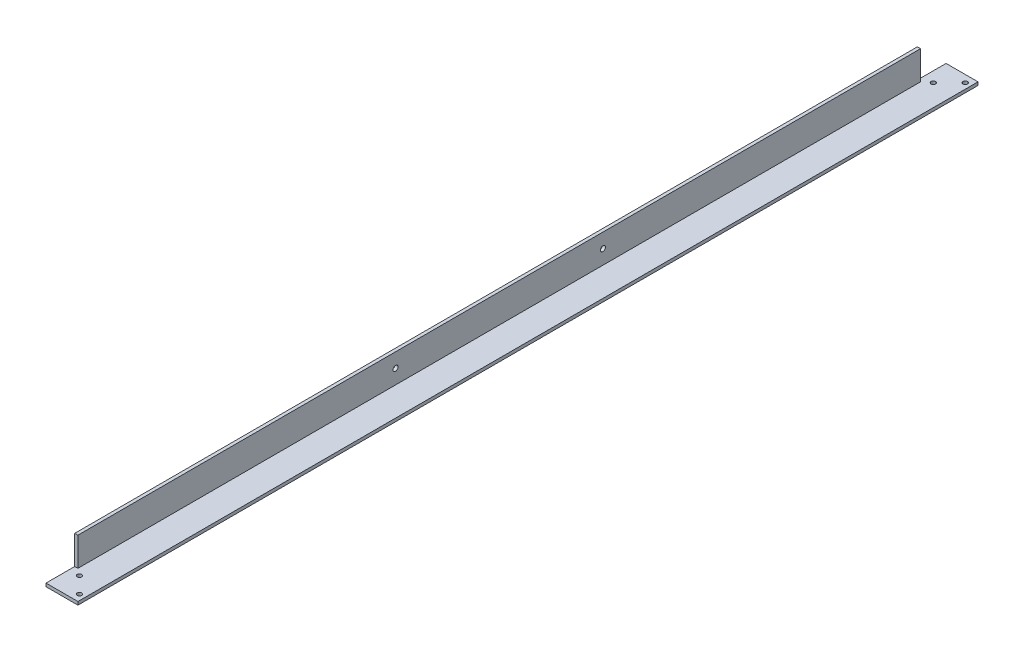
ISO-10303-21;
HEADER;
FILE_DESCRIPTION(('STEP AP214'),'2;1');
FILE_NAME('part.step','',(''),(''),'','','');
FILE_SCHEMA(('AUTOMOTIVE_DESIGN { 1 0 10303 214 1 1 1 1 }'));
ENDSEC;
DATA;
#1=APPLICATION_CONTEXT('core data for automotive mechanical design processes');
#2=APPLICATION_PROTOCOL_DEFINITION('international standard','automotive_design',2000,#1);
#3=PRODUCT_CONTEXT('',#1,'mechanical');
#4=PRODUCT('Part','Part','',(#3));
#5=PRODUCT_RELATED_PRODUCT_CATEGORY('part','',(#4));
#6=PRODUCT_DEFINITION_FORMATION('','',#4);
#7=PRODUCT_DEFINITION_CONTEXT('part definition',#1,'design');
#8=PRODUCT_DEFINITION('design','',#6,#7);
#9=PRODUCT_DEFINITION_SHAPE('','',#8);
#10=(LENGTH_UNIT() NAMED_UNIT(*) SI_UNIT(.MILLI.,.METRE.));
#11=(NAMED_UNIT(*) PLANE_ANGLE_UNIT() SI_UNIT($,.RADIAN.));
#12=(NAMED_UNIT(*) SI_UNIT($,.STERADIAN.) SOLID_ANGLE_UNIT());
#13=UNCERTAINTY_MEASURE_WITH_UNIT(LENGTH_MEASURE(1.E-05),#10,'distance_accuracy_value','');
#14=(GEOMETRIC_REPRESENTATION_CONTEXT(3) GLOBAL_UNCERTAINTY_ASSIGNED_CONTEXT((#13)) GLOBAL_UNIT_ASSIGNED_CONTEXT((#10,
#11,#12)) REPRESENTATION_CONTEXT('',''));
#15=CARTESIAN_POINT('',(0.,0.,0.));
#16=DIRECTION('',(0.,0.,1.));
#17=DIRECTION('',(1.,0.,0.));
#18=AXIS2_PLACEMENT_3D('',#15,#16,#17);
#19=CARTESIAN_POINT('',(0.,20.,564.));
#20=DIRECTION('',(1.,0.,0.));
#21=DIRECTION('',(0.,0.,-1.));
#22=AXIS2_PLACEMENT_3D('',#19,#20,#21);
#23=PLANE('',#22);
#24=CARTESIAN_POINT('',(0.,11.,217.));
#25=DIRECTION('',(-1.,0.,0.));
#26=DIRECTION('',(0.,0.,1.));
#27=AXIS2_PLACEMENT_3D('',#24,#25,#26);
#28=CIRCLE('',#27,1.59999999999999);
#29=CARTESIAN_POINT('',(0.,11.,218.6));
#30=VERTEX_POINT('',#29);
#31=EDGE_CURVE('E179',#30,#30,#28,.T.);
#32=ORIENTED_EDGE('',*,*,#31,.F.);
#33=EDGE_LOOP('',(#32));
#34=FACE_BOUND('',#33,.T.);
#35=CARTESIAN_POINT('',(0.,11.,347.));
#36=DIRECTION('',(-1.,0.,0.));
#37=DIRECTION('',(0.,0.,1.));
#38=AXIS2_PLACEMENT_3D('',#35,#36,#37);
#39=CIRCLE('',#38,1.59999999999996);
#40=CARTESIAN_POINT('',(0.,11.,348.6));
#41=VERTEX_POINT('',#40);
#42=EDGE_CURVE('E185',#41,#41,#39,.T.);
#43=ORIENTED_EDGE('',*,*,#42,.F.);
#44=EDGE_LOOP('',(#43));
#45=FACE_BOUND('',#44,.T.);
#46=DIRECTION('',(0.,0.,-1.));
#47=VECTOR('',#46,1.);
#48=CARTESIAN_POINT('',(0.,2.,564.));
#49=LINE('',#48,#47);
#50=CARTESIAN_POINT('',(0.,2.,564.));
#51=VERTEX_POINT('',#50);
#52=CARTESIAN_POINT('',(0.,2.,546.));
#53=VERTEX_POINT('',#52);
#54=EDGE_CURVE('E119',#51,#53,#49,.T.);
#55=ORIENTED_EDGE('',*,*,#54,.T.);
#56=DIRECTION('',(0.,1.,0.));
#57=VECTOR('',#56,1.);
#58=CARTESIAN_POINT('',(0.,20.,546.));
#59=LINE('',#58,#57);
#60=CARTESIAN_POINT('',(0.,20.,546.));
#61=VERTEX_POINT('',#60);
#62=EDGE_CURVE('E125',#53,#61,#59,.T.);
#63=ORIENTED_EDGE('',*,*,#62,.T.);
#64=DIRECTION('',(0.,0.,-1.));
#65=VECTOR('',#64,1.);
#66=CARTESIAN_POINT('',(0.,20.,564.));
#67=LINE('',#66,#65);
#68=CARTESIAN_POINT('',(0.,20.,18.));
#69=VERTEX_POINT('',#68);
#70=EDGE_CURVE('E164',#61,#69,#67,.T.);
#71=ORIENTED_EDGE('',*,*,#70,.T.);
#72=DIRECTION('',(0.,-1.,0.));
#73=VECTOR('',#72,1.);
#74=CARTESIAN_POINT('',(0.,20.,18.));
#75=LINE('',#74,#73);
#76=CARTESIAN_POINT('',(0.,2.,18.));
#77=VERTEX_POINT('',#76);
#78=EDGE_CURVE('E145',#69,#77,#75,.T.);
#79=ORIENTED_EDGE('',*,*,#78,.T.);
#80=DIRECTION('',(0.,0.,-1.));
#81=VECTOR('',#80,1.);
#82=CARTESIAN_POINT('',(0.,2.,0.));
#83=LINE('',#82,#81);
#84=CARTESIAN_POINT('',(0.,2.,0.));
#85=VERTEX_POINT('',#84);
#86=EDGE_CURVE('E148',#77,#85,#83,.T.);
#87=ORIENTED_EDGE('',*,*,#86,.T.);
#88=DIRECTION('',(0.,-1.,0.));
#89=VECTOR('',#88,1.);
#90=CARTESIAN_POINT('',(0.,20.,0.));
#91=LINE('',#90,#89);
#92=CARTESIAN_POINT('',(0.,0.,0.));
#93=VERTEX_POINT('',#92);
#94=EDGE_CURVE('E143',#85,#93,#91,.T.);
#95=ORIENTED_EDGE('',*,*,#94,.T.);
#96=DIRECTION('',(0.,0.,-1.));
#97=VECTOR('',#96,1.);
#98=CARTESIAN_POINT('',(0.,0.,564.));
#99=LINE('',#98,#97);
#100=CARTESIAN_POINT('',(0.,0.,564.));
#101=VERTEX_POINT('',#100);
#102=EDGE_CURVE('E11',#101,#93,#99,.T.);
#103=ORIENTED_EDGE('',*,*,#102,.F.);
#104=DIRECTION('',(0.,-1.,0.));
#105=VECTOR('',#104,1.);
#106=CARTESIAN_POINT('',(0.,20.,564.));
#107=LINE('',#106,#105);
#108=EDGE_CURVE('E85',#51,#101,#107,.T.);
#109=ORIENTED_EDGE('',*,*,#108,.F.);
#110=EDGE_LOOP('',(#55,#63,#71,#79,#87,#95,#103,#109));
#111=FACE_BOUND('',#110,.T.);
#112=ADVANCED_FACE('F43',(#34,#45,#111),#23,.F.);
#113=CARTESIAN_POINT('',(0.,0.,564.));
#114=DIRECTION('',(0.,1.,0.));
#115=DIRECTION('',(0.,0.,1.));
#116=AXIS2_PLACEMENT_3D('',#113,#114,#115);
#117=PLANE('',#116);
#118=CARTESIAN_POINT('',(16.48,0.,4.48000000000001));
#119=DIRECTION('',(0.,1.,0.));
#120=DIRECTION('',(1.,0.,0.));
#121=AXIS2_PLACEMENT_3D('',#118,#119,#120);
#122=CIRCLE('',#121,1.4);
#123=CARTESIAN_POINT('',(17.88,0.,4.48000000000001));
#124=VERTEX_POINT('',#123);
#125=EDGE_CURVE('E204',#124,#124,#122,.T.);
#126=ORIENTED_EDGE('',*,*,#125,.T.);
#127=EDGE_LOOP('',(#126));
#128=FACE_BOUND('',#127,.T.);
#129=CARTESIAN_POINT('',(16.48,0.,559.52));
#130=DIRECTION('',(0.,1.,0.));
#131=DIRECTION('',(-1.,0.,0.));
#132=AXIS2_PLACEMENT_3D('',#129,#130,#131);
#133=CIRCLE('',#132,1.39999999999999);
#134=CARTESIAN_POINT('',(15.08,0.,559.52));
#135=VERTEX_POINT('',#134);
#136=EDGE_CURVE('E198',#135,#135,#133,.T.);
#137=ORIENTED_EDGE('',*,*,#136,.T.);
#138=EDGE_LOOP('',(#137));
#139=FACE_BOUND('',#138,.T.);
#140=CARTESIAN_POINT('',(6.48,0.,14.48));
#141=DIRECTION('',(0.,1.,0.));
#142=DIRECTION('',(1.,0.,0.));
#143=AXIS2_PLACEMENT_3D('',#140,#141,#142);
#144=CIRCLE('',#143,1.4);
#145=CARTESIAN_POINT('',(7.88,0.,14.48));
#146=VERTEX_POINT('',#145);
#147=EDGE_CURVE('E192',#146,#146,#144,.T.);
#148=ORIENTED_EDGE('',*,*,#147,.T.);
#149=EDGE_LOOP('',(#148));
#150=FACE_BOUND('',#149,.T.);
#151=CARTESIAN_POINT('',(6.48,0.,549.52));
#152=DIRECTION('',(0.,1.,0.));
#153=DIRECTION('',(-1.,0.,0.));
#154=AXIS2_PLACEMENT_3D('',#151,#152,#153);
#155=CIRCLE('',#154,1.39999999999998);
#156=CARTESIAN_POINT('',(5.08000000000002,0.,549.52));
#157=VERTEX_POINT('',#156);
#158=EDGE_CURVE('E155',#157,#157,#155,.T.);
#159=ORIENTED_EDGE('',*,*,#158,.T.);
#160=EDGE_LOOP('',(#159));
#161=FACE_BOUND('',#160,.T.);
#162=DIRECTION('',(1.,0.,0.));
#163=VECTOR('',#162,1.);
#164=CARTESIAN_POINT('',(0.,0.,0.));
#165=LINE('',#164,#163);
#166=CARTESIAN_POINT('',(20.,0.,0.));
#167=VERTEX_POINT('',#166);
#168=EDGE_CURVE('E166',#93,#167,#165,.T.);
#169=ORIENTED_EDGE('',*,*,#168,.T.);
#170=DIRECTION('',(0.,0.,-1.));
#171=VECTOR('',#170,1.);
#172=CARTESIAN_POINT('',(20.,0.,564.));
#173=LINE('',#172,#171);
#174=CARTESIAN_POINT('',(20.,0.,564.));
#175=VERTEX_POINT('',#174);
#176=EDGE_CURVE('E51',#175,#167,#173,.T.);
#177=ORIENTED_EDGE('',*,*,#176,.F.);
#178=DIRECTION('',(1.,0.,0.));
#179=VECTOR('',#178,1.);
#180=CARTESIAN_POINT('',(0.,0.,564.));
#181=LINE('',#180,#179);
#182=EDGE_CURVE('E159',#101,#175,#181,.T.);
#183=ORIENTED_EDGE('',*,*,#182,.F.);
#184=ORIENTED_EDGE('',*,*,#102,.T.);
#185=EDGE_LOOP('',(#169,#177,#183,#184));
#186=FACE_BOUND('',#185,.T.);
#187=ADVANCED_FACE('F230',(#128,#139,#150,#161,#186),#117,.F.);
#188=CARTESIAN_POINT('',(20.,0.,564.));
#189=DIRECTION('',(-1.,0.,0.));
#190=DIRECTION('',(0.,0.,1.));
#191=AXIS2_PLACEMENT_3D('',#188,#189,#190);
#192=PLANE('',#191);
#193=DIRECTION('',(0.,1.,0.));
#194=VECTOR('',#193,1.);
#195=CARTESIAN_POINT('',(20.,0.,0.));
#196=LINE('',#195,#194);
#197=CARTESIAN_POINT('',(20.,2.,0.));
#198=VERTEX_POINT('',#197);
#199=EDGE_CURVE('E82',#167,#198,#196,.T.);
#200=ORIENTED_EDGE('',*,*,#199,.T.);
#201=DIRECTION('',(0.,0.,-1.));
#202=VECTOR('',#201,1.);
#203=CARTESIAN_POINT('',(20.,2.,564.));
#204=LINE('',#203,#202);
#205=CARTESIAN_POINT('',(20.,2.,564.));
#206=VERTEX_POINT('',#205);
#207=EDGE_CURVE('E175',#206,#198,#204,.T.);
#208=ORIENTED_EDGE('',*,*,#207,.F.);
#209=DIRECTION('',(0.,1.,0.));
#210=VECTOR('',#209,1.);
#211=CARTESIAN_POINT('',(20.,0.,564.));
#212=LINE('',#211,#210);
#213=EDGE_CURVE('E65',#175,#206,#212,.T.);
#214=ORIENTED_EDGE('',*,*,#213,.F.);
#215=ORIENTED_EDGE('',*,*,#176,.T.);
#216=EDGE_LOOP('',(#200,#208,#214,#215));
#217=FACE_BOUND('',#216,.T.);
#218=ADVANCED_FACE('F218',(#217),#192,.F.);
#219=CARTESIAN_POINT('',(20.,2.,564.));
#220=DIRECTION('',(0.,-1.,0.));
#221=DIRECTION('',(1.,0.,0.));
#222=AXIS2_PLACEMENT_3D('',#219,#220,#221);
#223=PLANE('',#222);
#224=CARTESIAN_POINT('',(16.48,2.,4.48000000000001));
#225=DIRECTION('',(0.,1.,0.));
#226=DIRECTION('',(1.,0.,0.));
#227=AXIS2_PLACEMENT_3D('',#224,#225,#226);
#228=CIRCLE('',#227,1.4);
#229=CARTESIAN_POINT('',(17.88,2.,4.48000000000001));
#230=VERTEX_POINT('',#229);
#231=EDGE_CURVE('E183',#230,#230,#228,.T.);
#232=ORIENTED_EDGE('',*,*,#231,.F.);
#233=EDGE_LOOP('',(#232));
#234=FACE_BOUND('',#233,.T.);
#235=CARTESIAN_POINT('',(16.48,2.,559.52));
#236=DIRECTION('',(0.,1.,0.));
#237=DIRECTION('',(-1.,0.,0.));
#238=AXIS2_PLACEMENT_3D('',#235,#236,#237);
#239=CIRCLE('',#238,1.39999999999999);
#240=CARTESIAN_POINT('',(15.08,2.,559.52));
#241=VERTEX_POINT('',#240);
#242=EDGE_CURVE('E201',#241,#241,#239,.T.);
#243=ORIENTED_EDGE('',*,*,#242,.F.);
#244=EDGE_LOOP('',(#243));
#245=FACE_BOUND('',#244,.T.);
#246=CARTESIAN_POINT('',(6.48,2.,14.48));
#247=DIRECTION('',(0.,1.,0.));
#248=DIRECTION('',(1.,0.,0.));
#249=AXIS2_PLACEMENT_3D('',#246,#247,#248);
#250=CIRCLE('',#249,1.4);
#251=CARTESIAN_POINT('',(7.88,2.,14.48));
#252=VERTEX_POINT('',#251);
#253=EDGE_CURVE('E195',#252,#252,#250,.T.);
#254=ORIENTED_EDGE('',*,*,#253,.F.);
#255=EDGE_LOOP('',(#254));
#256=FACE_BOUND('',#255,.T.);
#257=CARTESIAN_POINT('',(6.48,2.,549.52));
#258=DIRECTION('',(0.,1.,0.));
#259=DIRECTION('',(-1.,0.,0.));
#260=AXIS2_PLACEMENT_3D('',#257,#258,#259);
#261=CIRCLE('',#260,1.39999999999998);
#262=CARTESIAN_POINT('',(5.08000000000002,2.,549.52));
#263=VERTEX_POINT('',#262);
#264=EDGE_CURVE('E140',#263,#263,#261,.T.);
#265=ORIENTED_EDGE('',*,*,#264,.F.);
#266=EDGE_LOOP('',(#265));
#267=FACE_BOUND('',#266,.T.);
#268=DIRECTION('',(-1.,0.,0.));
#269=VECTOR('',#268,1.);
#270=CARTESIAN_POINT('',(20.,2.,0.));
#271=LINE('',#270,#269);
#272=EDGE_CURVE('E160',#198,#85,#271,.T.);
#273=ORIENTED_EDGE('',*,*,#272,.T.);
#274=ORIENTED_EDGE('',*,*,#86,.F.);
#275=DIRECTION('',(1.,0.,0.));
#276=VECTOR('',#275,1.);
#277=CARTESIAN_POINT('',(0.,2.,18.));
#278=LINE('',#277,#276);
#279=CARTESIAN_POINT('',(2.,2.,18.));
#280=VERTEX_POINT('',#279);
#281=EDGE_CURVE('E137',#77,#280,#278,.T.);
#282=ORIENTED_EDGE('',*,*,#281,.T.);
#283=DIRECTION('',(0.,0.,-1.));
#284=VECTOR('',#283,1.);
#285=CARTESIAN_POINT('',(2.,2.,564.));
#286=LINE('',#285,#284);
#287=CARTESIAN_POINT('',(2.,2.,546.));
#288=VERTEX_POINT('',#287);
#289=EDGE_CURVE('E121',#288,#280,#286,.T.);
#290=ORIENTED_EDGE('',*,*,#289,.F.);
#291=DIRECTION('',(1.,0.,0.));
#292=VECTOR('',#291,1.);
#293=CARTESIAN_POINT('',(0.,2.,546.));
#294=LINE('',#293,#292);
#295=EDGE_CURVE('E115',#53,#288,#294,.T.);
#296=ORIENTED_EDGE('',*,*,#295,.F.);
#297=ORIENTED_EDGE('',*,*,#54,.F.);
#298=DIRECTION('',(-1.,0.,0.));
#299=VECTOR('',#298,1.);
#300=CARTESIAN_POINT('',(20.,2.,564.));
#301=LINE('',#300,#299);
#302=EDGE_CURVE('E59',#206,#51,#301,.T.);
#303=ORIENTED_EDGE('',*,*,#302,.F.);
#304=ORIENTED_EDGE('',*,*,#207,.T.);
#305=EDGE_LOOP('',(#273,#274,#282,#290,#296,#297,#303,#304));
#306=FACE_BOUND('',#305,.T.);
#307=ADVANCED_FACE('F117',(#234,#245,#256,#267,#306),#223,.F.);
#308=CARTESIAN_POINT('',(2.,2.,564.));
#309=DIRECTION('',(-1.,0.,0.));
#310=DIRECTION('',(0.,0.,1.));
#311=AXIS2_PLACEMENT_3D('',#308,#309,#310);
#312=PLANE('',#311);
#313=CARTESIAN_POINT('',(2.,11.,217.));
#314=DIRECTION('',(-1.,0.,0.));
#315=DIRECTION('',(0.,0.,1.));
#316=AXIS2_PLACEMENT_3D('',#313,#314,#315);
#317=CIRCLE('',#316,1.59999999999999);
#318=CARTESIAN_POINT('',(2.,11.,218.6));
#319=VERTEX_POINT('',#318);
#320=EDGE_CURVE('E46',#319,#319,#317,.T.);
#321=ORIENTED_EDGE('',*,*,#320,.T.);
#322=EDGE_LOOP('',(#321));
#323=FACE_BOUND('',#322,.T.);
#324=CARTESIAN_POINT('',(2.,11.,347.));
#325=DIRECTION('',(-1.,0.,0.));
#326=DIRECTION('',(0.,0.,1.));
#327=AXIS2_PLACEMENT_3D('',#324,#325,#326);
#328=CIRCLE('',#327,1.59999999999996);
#329=CARTESIAN_POINT('',(2.,11.,348.6));
#330=VERTEX_POINT('',#329);
#331=EDGE_CURVE('E177',#330,#330,#328,.T.);
#332=ORIENTED_EDGE('',*,*,#331,.T.);
#333=EDGE_LOOP('',(#332));
#334=FACE_BOUND('',#333,.T.);
#335=DIRECTION('',(0.,0.,-1.));
#336=VECTOR('',#335,1.);
#337=CARTESIAN_POINT('',(2.,20.,564.));
#338=LINE('',#337,#336);
#339=CARTESIAN_POINT('',(2.,20.,546.));
#340=VERTEX_POINT('',#339);
#341=CARTESIAN_POINT('',(2.,20.,18.));
#342=VERTEX_POINT('',#341);
#343=EDGE_CURVE('E171',#340,#342,#338,.T.);
#344=ORIENTED_EDGE('',*,*,#343,.F.);
#345=DIRECTION('',(0.,1.,0.));
#346=VECTOR('',#345,1.);
#347=CARTESIAN_POINT('',(2.,20.,546.));
#348=LINE('',#347,#346);
#349=EDGE_CURVE('E135',#288,#340,#348,.T.);
#350=ORIENTED_EDGE('',*,*,#349,.F.);
#351=ORIENTED_EDGE('',*,*,#289,.T.);
#352=DIRECTION('',(0.,-1.,0.));
#353=VECTOR('',#352,1.);
#354=CARTESIAN_POINT('',(2.,20.,18.));
#355=LINE('',#354,#353);
#356=EDGE_CURVE('E149',#342,#280,#355,.T.);
#357=ORIENTED_EDGE('',*,*,#356,.F.);
#358=EDGE_LOOP('',(#344,#350,#351,#357));
#359=FACE_BOUND('',#358,.T.);
#360=ADVANCED_FACE('F217',(#323,#334,#359),#312,.F.);
#361=CARTESIAN_POINT('',(2.,20.,564.));
#362=DIRECTION('',(0.,-1.,0.));
#363=DIRECTION('',(0.,0.,-1.));
#364=AXIS2_PLACEMENT_3D('',#361,#362,#363);
#365=PLANE('',#364);
#366=ORIENTED_EDGE('',*,*,#70,.F.);
#367=DIRECTION('',(1.,0.,0.));
#368=VECTOR('',#367,1.);
#369=CARTESIAN_POINT('',(0.,20.,546.));
#370=LINE('',#369,#368);
#371=EDGE_CURVE('E124',#61,#340,#370,.T.);
#372=ORIENTED_EDGE('',*,*,#371,.T.);
#373=ORIENTED_EDGE('',*,*,#343,.T.);
#374=DIRECTION('',(1.,0.,0.));
#375=VECTOR('',#374,1.);
#376=CARTESIAN_POINT('',(0.,20.,18.));
#377=LINE('',#376,#375);
#378=EDGE_CURVE('E152',#69,#342,#377,.T.);
#379=ORIENTED_EDGE('',*,*,#378,.F.);
#380=EDGE_LOOP('',(#366,#372,#373,#379));
#381=FACE_BOUND('',#380,.T.);
#382=ADVANCED_FACE('F226',(#381),#365,.F.);
#383=CARTESIAN_POINT('',(0.,0.,564.));
#384=DIRECTION('',(0.,0.,1.));
#385=DIRECTION('',(1.,0.,0.));
#386=AXIS2_PLACEMENT_3D('',#383,#384,#385);
#387=PLANE('',#386);
#388=ORIENTED_EDGE('',*,*,#302,.T.);
#389=ORIENTED_EDGE('',*,*,#108,.T.);
#390=ORIENTED_EDGE('',*,*,#182,.T.);
#391=ORIENTED_EDGE('',*,*,#213,.T.);
#392=EDGE_LOOP('',(#388,#389,#390,#391));
#393=FACE_BOUND('',#392,.T.);
#394=ADVANCED_FACE('F273',(#393),#387,.T.);
#395=CARTESIAN_POINT('',(0.,0.,0.));
#396=DIRECTION('',(0.,0.,1.));
#397=DIRECTION('',(1.,0.,0.));
#398=AXIS2_PLACEMENT_3D('',#395,#396,#397);
#399=PLANE('',#398);
#400=ORIENTED_EDGE('',*,*,#94,.F.);
#401=ORIENTED_EDGE('',*,*,#272,.F.);
#402=ORIENTED_EDGE('',*,*,#199,.F.);
#403=ORIENTED_EDGE('',*,*,#168,.F.);
#404=EDGE_LOOP('',(#400,#401,#402,#403));
#405=FACE_BOUND('',#404,.T.);
#406=ADVANCED_FACE('F271',(#405),#399,.F.);
#407=CARTESIAN_POINT('',(0.,20.,18.));
#408=DIRECTION('',(0.,0.,1.));
#409=DIRECTION('',(1.,0.,0.));
#410=AXIS2_PLACEMENT_3D('',#407,#408,#409);
#411=PLANE('',#410);
#412=ORIENTED_EDGE('',*,*,#356,.T.);
#413=ORIENTED_EDGE('',*,*,#281,.F.);
#414=ORIENTED_EDGE('',*,*,#78,.F.);
#415=ORIENTED_EDGE('',*,*,#378,.T.);
#416=EDGE_LOOP('',(#412,#413,#414,#415));
#417=FACE_BOUND('',#416,.T.);
#418=ADVANCED_FACE('F268',(#417),#411,.F.);
#419=CARTESIAN_POINT('',(0.,20.,546.));
#420=DIRECTION('',(0.,0.,-1.));
#421=DIRECTION('',(-1.,0.,0.));
#422=AXIS2_PLACEMENT_3D('',#419,#420,#421);
#423=PLANE('',#422);
#424=ORIENTED_EDGE('',*,*,#349,.T.);
#425=ORIENTED_EDGE('',*,*,#371,.F.);
#426=ORIENTED_EDGE('',*,*,#62,.F.);
#427=ORIENTED_EDGE('',*,*,#295,.T.);
#428=EDGE_LOOP('',(#424,#425,#426,#427));
#429=FACE_BOUND('',#428,.T.);
#430=ADVANCED_FACE('F128',(#429),#423,.F.);
#431=CARTESIAN_POINT('',(6.48,0.,549.52));
#432=DIRECTION('',(0.,1.,0.));
#433=DIRECTION('',(-1.,0.,0.));
#434=AXIS2_PLACEMENT_3D('',#431,#432,#433);
#435=CYLINDRICAL_SURFACE('',#434,1.39999999999998);
#436=ORIENTED_EDGE('',*,*,#158,.F.);
#437=EDGE_LOOP('',(#436));
#438=FACE_BOUND('',#437,.T.);
#439=ORIENTED_EDGE('',*,*,#264,.T.);
#440=EDGE_LOOP('',(#439));
#441=FACE_BOUND('',#440,.T.);
#442=ADVANCED_FACE('F214',(#438,#441),#435,.F.);
#443=CARTESIAN_POINT('',(6.48,0.,14.48));
#444=DIRECTION('',(0.,1.,0.));
#445=DIRECTION('',(-1.,0.,0.));
#446=AXIS2_PLACEMENT_3D('',#443,#444,#445);
#447=CYLINDRICAL_SURFACE('',#446,1.4);
#448=ORIENTED_EDGE('',*,*,#147,.F.);
#449=EDGE_LOOP('',(#448));
#450=FACE_BOUND('',#449,.T.);
#451=ORIENTED_EDGE('',*,*,#253,.T.);
#452=EDGE_LOOP('',(#451));
#453=FACE_BOUND('',#452,.T.);
#454=ADVANCED_FACE('F257',(#450,#453),#447,.F.);
#455=CARTESIAN_POINT('',(16.48,0.,559.52));
#456=DIRECTION('',(0.,1.,0.));
#457=DIRECTION('',(-1.,0.,0.));
#458=AXIS2_PLACEMENT_3D('',#455,#456,#457);
#459=CYLINDRICAL_SURFACE('',#458,1.39999999999999);
#460=ORIENTED_EDGE('',*,*,#136,.F.);
#461=EDGE_LOOP('',(#460));
#462=FACE_BOUND('',#461,.T.);
#463=ORIENTED_EDGE('',*,*,#242,.T.);
#464=EDGE_LOOP('',(#463));
#465=FACE_BOUND('',#464,.T.);
#466=ADVANCED_FACE('F253',(#462,#465),#459,.F.);
#467=CARTESIAN_POINT('',(16.48,0.,4.48000000000001));
#468=DIRECTION('',(0.,1.,0.));
#469=DIRECTION('',(-1.,0.,0.));
#470=AXIS2_PLACEMENT_3D('',#467,#468,#469);
#471=CYLINDRICAL_SURFACE('',#470,1.4);
#472=ORIENTED_EDGE('',*,*,#125,.F.);
#473=EDGE_LOOP('',(#472));
#474=FACE_BOUND('',#473,.T.);
#475=ORIENTED_EDGE('',*,*,#231,.T.);
#476=EDGE_LOOP('',(#475));
#477=FACE_BOUND('',#476,.T.);
#478=ADVANCED_FACE('F247',(#474,#477),#471,.F.);
#479=CARTESIAN_POINT('',(20.,11.,347.));
#480=DIRECTION('',(-1.,0.,0.));
#481=DIRECTION('',(0.,0.,1.));
#482=AXIS2_PLACEMENT_3D('',#479,#480,#481);
#483=CYLINDRICAL_SURFACE('',#482,1.59999999999996);
#484=ORIENTED_EDGE('',*,*,#42,.T.);
#485=EDGE_LOOP('',(#484));
#486=FACE_BOUND('',#485,.T.);
#487=ORIENTED_EDGE('',*,*,#331,.F.);
#488=EDGE_LOOP('',(#487));
#489=FACE_BOUND('',#488,.T.);
#490=ADVANCED_FACE('F243',(#486,#489),#483,.F.);
#491=CARTESIAN_POINT('',(20.,11.,217.));
#492=DIRECTION('',(-1.,0.,0.));
#493=DIRECTION('',(0.,0.,1.));
#494=AXIS2_PLACEMENT_3D('',#491,#492,#493);
#495=CYLINDRICAL_SURFACE('',#494,1.59999999999999);
#496=ORIENTED_EDGE('',*,*,#31,.T.);
#497=EDGE_LOOP('',(#496));
#498=FACE_BOUND('',#497,.T.);
#499=ORIENTED_EDGE('',*,*,#320,.F.);
#500=EDGE_LOOP('',(#499));
#501=FACE_BOUND('',#500,.T.);
#502=ADVANCED_FACE('F246',(#498,#501),#495,.F.);
#503=CLOSED_SHELL('',(#112,#187,#218,#307,#360,#382,#394,#406,#418,#430,#442,#454,#466,#478,
#490,#502));
#504=MANIFOLD_SOLID_BREP('B2',#503);
#505=ADVANCED_BREP_SHAPE_REPRESENTATION('',(#18,#504),#14);
#506=SHAPE_DEFINITION_REPRESENTATION(#9,#505);
ENDSEC;
END-ISO-10303-21;
